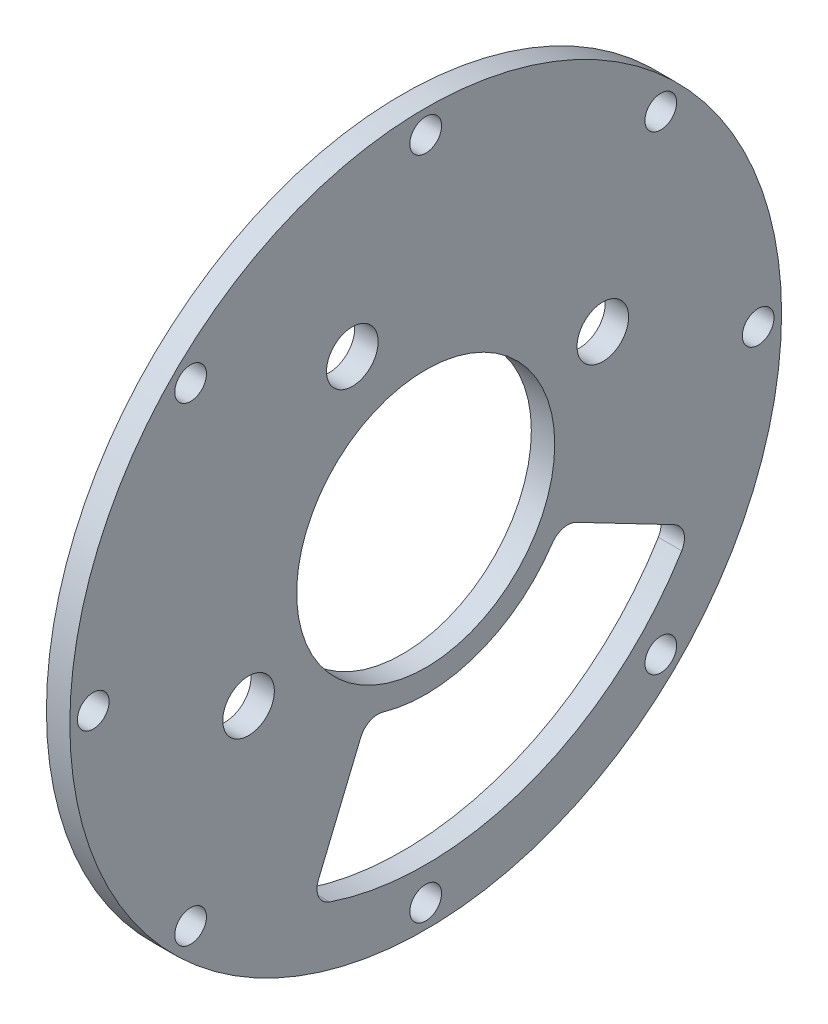
ISO-10303-21;
HEADER;
FILE_DESCRIPTION(('STEP AP214'),'2;1');
FILE_NAME('part.step','',(''),(''),'','','');
FILE_SCHEMA(('AUTOMOTIVE_DESIGN { 1 0 10303 214 1 1 1 1 }'));
ENDSEC;
DATA;
#1=APPLICATION_CONTEXT('core data for automotive mechanical design processes');
#2=APPLICATION_PROTOCOL_DEFINITION('international standard','automotive_design',2000,#1);
#3=PRODUCT_CONTEXT('',#1,'mechanical');
#4=PRODUCT('Part','Part','',(#3));
#5=PRODUCT_RELATED_PRODUCT_CATEGORY('part','',(#4));
#6=PRODUCT_DEFINITION_FORMATION('','',#4);
#7=PRODUCT_DEFINITION_CONTEXT('part definition',#1,'design');
#8=PRODUCT_DEFINITION('design','',#6,#7);
#9=PRODUCT_DEFINITION_SHAPE('','',#8);
#10=(LENGTH_UNIT() NAMED_UNIT(*) SI_UNIT(.MILLI.,.METRE.));
#11=(NAMED_UNIT(*) PLANE_ANGLE_UNIT() SI_UNIT($,.RADIAN.));
#12=(NAMED_UNIT(*) SI_UNIT($,.STERADIAN.) SOLID_ANGLE_UNIT());
#13=UNCERTAINTY_MEASURE_WITH_UNIT(LENGTH_MEASURE(1.E-05),#10,'distance_accuracy_value','');
#14=(GEOMETRIC_REPRESENTATION_CONTEXT(3) GLOBAL_UNCERTAINTY_ASSIGNED_CONTEXT((#13)) GLOBAL_UNIT_ASSIGNED_CONTEXT((#10,
#11,#12)) REPRESENTATION_CONTEXT('',''));
#15=CARTESIAN_POINT('',(0.,0.,0.));
#16=DIRECTION('',(0.,0.,1.));
#17=DIRECTION('',(1.,0.,0.));
#18=AXIS2_PLACEMENT_3D('',#15,#16,#17);
#19=CARTESIAN_POINT('',(3.175,0.,0.));
#20=DIRECTION('',(1.,0.,0.));
#21=DIRECTION('',(0.,0.,-1.));
#22=AXIS2_PLACEMENT_3D('',#19,#20,#21);
#23=PLANE('',#22);
#24=CARTESIAN_POINT('',(3.175,0.,0.));
#25=DIRECTION('',(1.,0.,0.));
#26=DIRECTION('',(0.,0.,-1.));
#27=AXIS2_PLACEMENT_3D('',#24,#25,#26);
#28=CIRCLE('',#27,17.5);
#29=CARTESIAN_POINT('',(3.175,0.,-17.5));
#30=VERTEX_POINT('',#29);
#31=EDGE_CURVE('E164',#30,#30,#28,.T.);
#32=ORIENTED_EDGE('',*,*,#31,.F.);
#33=EDGE_LOOP('',(#32));
#34=FACE_BOUND('',#33,.T.);
#35=CARTESIAN_POINT('',(3.175,-6.59194920871187E-13,45.0849999999993));
#36=DIRECTION('',(1.,0.,0.));
#37=DIRECTION('',(0.,0.,-1.));
#38=AXIS2_PLACEMENT_3D('',#35,#36,#37);
#39=CIRCLE('',#38,2.15264999999998);
#40=CARTESIAN_POINT('',(3.175,-6.59194920871187E-13,42.9323499999993));
#41=VERTEX_POINT('',#40);
#42=EDGE_CURVE('E176',#41,#41,#39,.T.);
#43=ORIENTED_EDGE('',*,*,#42,.F.);
#44=EDGE_LOOP('',(#43));
#45=FACE_BOUND('',#44,.T.);
#46=CARTESIAN_POINT('',(3.175,-45.085,-1.27675647831893E-12));
#47=DIRECTION('',(1.,0.,0.));
#48=DIRECTION('',(0.,0.,-1.));
#49=AXIS2_PLACEMENT_3D('',#46,#47,#48);
#50=CIRCLE('',#49,2.15265000000001);
#51=CARTESIAN_POINT('',(3.175,-45.085,-2.15265000000128));
#52=VERTEX_POINT('',#51);
#53=EDGE_CURVE('E188',#52,#52,#50,.T.);
#54=ORIENTED_EDGE('',*,*,#53,.F.);
#55=EDGE_LOOP('',(#54));
#56=FACE_BOUND('',#55,.T.);
#57=CARTESIAN_POINT('',(3.175,24.0239680756289,9.95038529971896));
#58=DIRECTION('',(1.,0.,0.));
#59=DIRECTION('',(0.,0.,1.));
#60=AXIS2_PLACEMENT_3D('',#57,#58,#59);
#61=CIRCLE('',#60,3.49999999999999);
#62=CARTESIAN_POINT('',(3.175,24.0239680756289,13.4503852997189));
#63=VERTEX_POINT('',#62);
#64=EDGE_CURVE('E200',#63,#63,#61,.T.);
#65=ORIENTED_EDGE('',*,*,#64,.F.);
#66=EDGE_LOOP('',(#65));
#67=FACE_BOUND('',#66,.T.);
#68=CARTESIAN_POINT('',(3.175,-1.59594559789866E-13,-45.085));
#69=DIRECTION('',(1.,0.,0.));
#70=DIRECTION('',(0.,0.,-1.));
#71=AXIS2_PLACEMENT_3D('',#68,#69,#70);
#72=CIRCLE('',#71,2.15265000000001);
#73=CARTESIAN_POINT('',(3.175,-1.59594559789866E-13,-47.23765));
#74=VERTEX_POINT('',#73);
#75=EDGE_CURVE('E212',#74,#74,#72,.T.);
#76=ORIENTED_EDGE('',*,*,#75,.F.);
#77=EDGE_LOOP('',(#76));
#78=FACE_BOUND('',#77,.T.);
#79=CARTESIAN_POINT('',(3.175,-9.95080194897357,24.023795501211));
#80=DIRECTION('',(1.,0.,0.));
#81=DIRECTION('',(0.,0.,-1.));
#82=AXIS2_PLACEMENT_3D('',#79,#80,#81);
#83=CIRCLE('',#82,3.49999999999999);
#84=CARTESIAN_POINT('',(3.175,-9.95080194897357,20.523795501211));
#85=VERTEX_POINT('',#84);
#86=EDGE_CURVE('E224',#85,#85,#83,.T.);
#87=ORIENTED_EDGE('',*,*,#86,.F.);
#88=EDGE_LOOP('',(#87));
#89=FACE_BOUND('',#88,.T.);
#90=CARTESIAN_POINT('',(3.175,0.,0.));
#91=DIRECTION('',(1.,0.,0.));
#92=DIRECTION('',(0.,0.,-1.));
#93=AXIS2_PLACEMENT_3D('',#90,#91,#92);
#94=CIRCLE('',#93,48.26);
#95=CARTESIAN_POINT('',(3.175,0.,-48.26));
#96=VERTEX_POINT('',#95);
#97=EDGE_CURVE('E11',#96,#96,#94,.T.);
#98=ORIENTED_EDGE('',*,*,#97,.T.);
#99=EDGE_LOOP('',(#98));
#100=FACE_BOUND('',#99,.T.);
#101=CARTESIAN_POINT('',(3.175,45.085,0.));
#102=DIRECTION('',(1.,0.,0.));
#103=DIRECTION('',(0.,0.,-1.));
#104=AXIS2_PLACEMENT_3D('',#101,#102,#103);
#105=CIRCLE('',#104,2.15265000000001);
#106=CARTESIAN_POINT('',(3.175,45.085,-2.15265000000001));
#107=VERTEX_POINT('',#106);
#108=EDGE_CURVE('E230',#107,#107,#105,.T.);
#109=ORIENTED_EDGE('',*,*,#108,.F.);
#110=EDGE_LOOP('',(#109));
#111=FACE_BOUND('',#110,.T.);
#112=CARTESIAN_POINT('',(3.175,31.8799092297954,-31.8799092297956));
#113=DIRECTION('',(1.,0.,0.));
#114=DIRECTION('',(0.,0.,-1.));
#115=AXIS2_PLACEMENT_3D('',#112,#113,#114);
#116=CIRCLE('',#115,2.15265000000001);
#117=CARTESIAN_POINT('',(3.175,31.8799092297954,-34.0325592297956));
#118=VERTEX_POINT('',#117);
#119=EDGE_CURVE('E218',#118,#118,#116,.T.);
#120=ORIENTED_EDGE('',*,*,#119,.F.);
#121=EDGE_LOOP('',(#120));
#122=FACE_BOUND('',#121,.T.);
#123=CARTESIAN_POINT('',(3.175,9.94801274798736,-24.0182399849756));
#124=DIRECTION('',(1.,0.,0.));
#125=DIRECTION('',(0.,0.,-1.));
#126=AXIS2_PLACEMENT_3D('',#123,#124,#125);
#127=CIRCLE('',#126,3.50000000000001);
#128=CARTESIAN_POINT('',(3.175,9.94801274798736,-27.5182399849756));
#129=VERTEX_POINT('',#128);
#130=EDGE_CURVE('E206',#129,#129,#127,.T.);
#131=ORIENTED_EDGE('',*,*,#130,.F.);
#132=EDGE_LOOP('',(#131));
#133=FACE_BOUND('',#132,.T.);
#134=CARTESIAN_POINT('',(3.175,-31.879909229795,-31.8799092297966));
#135=DIRECTION('',(1.,0.,0.));
#136=DIRECTION('',(0.,0.,-1.));
#137=AXIS2_PLACEMENT_3D('',#134,#135,#136);
#138=CIRCLE('',#137,2.15264999999998);
#139=CARTESIAN_POINT('',(3.175,-31.879909229795,-34.0325592297966));
#140=VERTEX_POINT('',#139);
#141=EDGE_CURVE('E194',#140,#140,#138,.T.);
#142=ORIENTED_EDGE('',*,*,#141,.F.);
#143=EDGE_LOOP('',(#142));
#144=FACE_BOUND('',#143,.T.);
#145=CARTESIAN_POINT('',(3.175,-31.879909229796,31.8799092297944));
#146=DIRECTION('',(1.,0.,0.));
#147=DIRECTION('',(0.,0.,-1.));
#148=AXIS2_PLACEMENT_3D('',#145,#146,#147);
#149=CIRCLE('',#148,2.15264999999998);
#150=CARTESIAN_POINT('',(3.175,-31.879909229796,29.7272592297944));
#151=VERTEX_POINT('',#150);
#152=EDGE_CURVE('E182',#151,#151,#149,.T.);
#153=ORIENTED_EDGE('',*,*,#152,.F.);
#154=EDGE_LOOP('',(#153));
#155=FACE_BOUND('',#154,.T.);
#156=CARTESIAN_POINT('',(3.175,31.8799092297959,31.8799092297951));
#157=DIRECTION('',(1.,0.,0.));
#158=DIRECTION('',(0.,0.,-1.));
#159=AXIS2_PLACEMENT_3D('',#156,#157,#158);
#160=CIRCLE('',#159,2.15264999999998);
#161=CARTESIAN_POINT('',(3.175,31.8799092297959,29.7272592297951));
#162=VERTEX_POINT('',#161);
#163=EDGE_CURVE('E170',#162,#162,#160,.T.);
#164=ORIENTED_EDGE('',*,*,#163,.F.);
#165=EDGE_LOOP('',(#164));
#166=FACE_BOUND('',#165,.T.);
#167=CARTESIAN_POINT('',(3.175,0.,0.));
#168=DIRECTION('',(-1.,0.,0.));
#169=DIRECTION('',(0.,0.,1.));
#170=AXIS2_PLACEMENT_3D('',#167,#168,#169);
#171=CIRCLE('',#170,20.6374999999999);
#172=CARTESIAN_POINT('',(3.175,-11.4780442266633,-17.1511197004965));
#173=VERTEX_POINT('',#172);
#174=CARTESIAN_POINT('',(3.175,-19.8172192334389,5.76057532750126));
#175=VERTEX_POINT('',#174);
#176=EDGE_CURVE('E107',#173,#175,#171,.T.);
#177=ORIENTED_EDGE('',*,*,#176,.F.);
#178=CARTESIAN_POINT('',(3.175,-12.8907265930218,-19.2620267405576));
#179=DIRECTION('',(1.,0.,0.));
#180=DIRECTION('',(0.,0.,-1.));
#181=AXIS2_PLACEMENT_3D('',#178,#179,#180);
#182=CIRCLE('',#181,2.54);
#183=CARTESIAN_POINT('',(3.175,-10.6377190767492,-20.4348682181746));
#184=VERTEX_POINT('',#183);
#185=EDGE_CURVE('E99',#184,#173,#182,.T.);
#186=ORIENTED_EDGE('',*,*,#185,.F.);
#187=DIRECTION('',(0.,0.461748613235052,0.887010833178213));
#188=VECTOR('',#187,1.);
#189=CARTESIAN_POINT('',(3.175,-10.6377190767492,-20.4348682181746));
#190=LINE('',#189,#188);
#191=CARTESIAN_POINT('',(3.175,-17.5534839129624,-33.7199288628752));
#192=VERTEX_POINT('',#191);
#193=EDGE_CURVE('E132',#192,#184,#190,.T.);
#194=ORIENTED_EDGE('',*,*,#193,.F.);
#195=CARTESIAN_POINT('',(3.175,-19.8064914292351,-32.5470873852582));
#196=DIRECTION('',(1.,0.,0.));
#197=DIRECTION('',(0.,0.,1.));
#198=AXIS2_PLACEMENT_3D('',#195,#196,#197);
#199=CIRCLE('',#198,2.54000000000002);
#200=CARTESIAN_POINT('',(3.175,-21.1269241911841,-34.7168932109421));
#201=VERTEX_POINT('',#200);
#202=EDGE_CURVE('E130',#201,#192,#199,.T.);
#203=ORIENTED_EDGE('',*,*,#202,.F.);
#204=CARTESIAN_POINT('',(3.175,0.,0.));
#205=DIRECTION('',(1.,0.,0.));
#206=DIRECTION('',(0.,0.,1.));
#207=AXIS2_PLACEMENT_3D('',#204,#205,#206);
#208=CIRCLE('',#207,40.6399999999999);
#209=CARTESIAN_POINT('',(3.175,-38.4997516796562,13.0145580257188));
#210=VERTEX_POINT('',#209);
#211=EDGE_CURVE('E128',#210,#201,#208,.T.);
#212=ORIENTED_EDGE('',*,*,#211,.F.);
#213=CARTESIAN_POINT('',(3.175,-36.0935171996777,12.2011481491114));
#214=DIRECTION('',(1.,0.,0.));
#215=DIRECTION('',(0.,0.,1.));
#216=AXIS2_PLACEMENT_3D('',#213,#214,#215);
#217=CIRCLE('',#216,2.53999999999999);
#218=CARTESIAN_POINT('',(3.175,-35.1215012814703,14.54780216169));
#219=VERTEX_POINT('',#218);
#220=EDGE_CURVE('E126',#219,#210,#217,.T.);
#221=ORIENTED_EDGE('',*,*,#220,.F.);
#222=DIRECTION('',(0.,-0.923879532511278,0.38268343236511));
#223=VECTOR('',#222,1.);
#224=CARTESIAN_POINT('',(3.175,-21.284245682424,8.81622322654163));
#225=LINE('',#224,#223);
#226=CARTESIAN_POINT('',(3.175,-21.284245682424,8.81622322654163));
#227=VERTEX_POINT('',#226);
#228=EDGE_CURVE('E122',#227,#219,#225,.T.);
#229=ORIENTED_EDGE('',*,*,#228,.F.);
#230=CARTESIAN_POINT('',(3.175,-22.2562616006314,6.46956921396297));
#231=DIRECTION('',(1.,0.,0.));
#232=DIRECTION('',(0.,0.,-1.));
#233=AXIS2_PLACEMENT_3D('',#230,#231,#232);
#234=CIRCLE('',#233,2.54000000000001);
#235=EDGE_CURVE('E120',#175,#227,#234,.T.);
#236=ORIENTED_EDGE('',*,*,#235,.F.);
#237=EDGE_LOOP('',(#177,#186,#194,#203,#212,#221,#229,#236));
#238=FACE_BOUND('',#237,.T.);
#239=ADVANCED_FACE('F34',(#34,#45,#56,#67,#78,#89,#100,#111,#122,#133,#144,#155,#166,#238),#23,.T.);
#240=CARTESIAN_POINT('',(0.,0.,0.));
#241=DIRECTION('',(1.,0.,0.));
#242=DIRECTION('',(0.,0.,-1.));
#243=AXIS2_PLACEMENT_3D('',#240,#241,#242);
#244=PLANE('',#243);
#245=CARTESIAN_POINT('',(0.,0.,0.));
#246=DIRECTION('',(1.,0.,0.));
#247=DIRECTION('',(0.,0.,-1.));
#248=AXIS2_PLACEMENT_3D('',#245,#246,#247);
#249=CIRCLE('',#248,17.5);
#250=CARTESIAN_POINT('',(0.,0.,-17.5));
#251=VERTEX_POINT('',#250);
#252=EDGE_CURVE('E115',#251,#251,#249,.T.);
#253=ORIENTED_EDGE('',*,*,#252,.T.);
#254=EDGE_LOOP('',(#253));
#255=FACE_BOUND('',#254,.T.);
#256=CARTESIAN_POINT('',(0.,-6.59194920871187E-13,45.0849999999993));
#257=DIRECTION('',(1.,0.,0.));
#258=DIRECTION('',(0.,0.,-1.));
#259=AXIS2_PLACEMENT_3D('',#256,#257,#258);
#260=CIRCLE('',#259,2.15264999999998);
#261=CARTESIAN_POINT('',(0.,-6.59194920871187E-13,42.9323499999993));
#262=VERTEX_POINT('',#261);
#263=EDGE_CURVE('E173',#262,#262,#260,.T.);
#264=ORIENTED_EDGE('',*,*,#263,.T.);
#265=EDGE_LOOP('',(#264));
#266=FACE_BOUND('',#265,.T.);
#267=CARTESIAN_POINT('',(0.,-45.085,-1.27675647831893E-12));
#268=DIRECTION('',(1.,0.,0.));
#269=DIRECTION('',(0.,0.,-1.));
#270=AXIS2_PLACEMENT_3D('',#267,#268,#269);
#271=CIRCLE('',#270,2.15265000000001);
#272=CARTESIAN_POINT('',(0.,-45.085,-2.15265000000128));
#273=VERTEX_POINT('',#272);
#274=EDGE_CURVE('E185',#273,#273,#271,.T.);
#275=ORIENTED_EDGE('',*,*,#274,.T.);
#276=EDGE_LOOP('',(#275));
#277=FACE_BOUND('',#276,.T.);
#278=CARTESIAN_POINT('',(0.,24.0239680756289,9.95038529971896));
#279=DIRECTION('',(1.,0.,0.));
#280=DIRECTION('',(0.,0.,1.));
#281=AXIS2_PLACEMENT_3D('',#278,#279,#280);
#282=CIRCLE('',#281,3.49999999999999);
#283=CARTESIAN_POINT('',(0.,24.0239680756289,13.4503852997189));
#284=VERTEX_POINT('',#283);
#285=EDGE_CURVE('E197',#284,#284,#282,.T.);
#286=ORIENTED_EDGE('',*,*,#285,.T.);
#287=EDGE_LOOP('',(#286));
#288=FACE_BOUND('',#287,.T.);
#289=CARTESIAN_POINT('',(0.,-1.59594559789866E-13,-45.085));
#290=DIRECTION('',(1.,0.,0.));
#291=DIRECTION('',(0.,0.,-1.));
#292=AXIS2_PLACEMENT_3D('',#289,#290,#291);
#293=CIRCLE('',#292,2.15265000000001);
#294=CARTESIAN_POINT('',(0.,-1.59594559789866E-13,-47.23765));
#295=VERTEX_POINT('',#294);
#296=EDGE_CURVE('E209',#295,#295,#293,.T.);
#297=ORIENTED_EDGE('',*,*,#296,.T.);
#298=EDGE_LOOP('',(#297));
#299=FACE_BOUND('',#298,.T.);
#300=CARTESIAN_POINT('',(0.,-9.95080194897357,24.023795501211));
#301=DIRECTION('',(1.,0.,0.));
#302=DIRECTION('',(0.,0.,-1.));
#303=AXIS2_PLACEMENT_3D('',#300,#301,#302);
#304=CIRCLE('',#303,3.49999999999999);
#305=CARTESIAN_POINT('',(0.,-9.95080194897357,20.523795501211));
#306=VERTEX_POINT('',#305);
#307=EDGE_CURVE('E221',#306,#306,#304,.T.);
#308=ORIENTED_EDGE('',*,*,#307,.T.);
#309=EDGE_LOOP('',(#308));
#310=FACE_BOUND('',#309,.T.);
#311=CARTESIAN_POINT('',(0.,0.,0.));
#312=DIRECTION('',(1.,0.,0.));
#313=DIRECTION('',(0.,0.,-1.));
#314=AXIS2_PLACEMENT_3D('',#311,#312,#313);
#315=CIRCLE('',#314,48.26);
#316=CARTESIAN_POINT('',(0.,0.,-48.26));
#317=VERTEX_POINT('',#316);
#318=EDGE_CURVE('E38',#317,#317,#315,.T.);
#319=ORIENTED_EDGE('',*,*,#318,.F.);
#320=EDGE_LOOP('',(#319));
#321=FACE_BOUND('',#320,.T.);
#322=CARTESIAN_POINT('',(0.,45.085,0.));
#323=DIRECTION('',(1.,0.,0.));
#324=DIRECTION('',(0.,0.,-1.));
#325=AXIS2_PLACEMENT_3D('',#322,#323,#324);
#326=CIRCLE('',#325,2.15265000000001);
#327=CARTESIAN_POINT('',(0.,45.085,-2.15265000000001));
#328=VERTEX_POINT('',#327);
#329=EDGE_CURVE('E227',#328,#328,#326,.T.);
#330=ORIENTED_EDGE('',*,*,#329,.T.);
#331=EDGE_LOOP('',(#330));
#332=FACE_BOUND('',#331,.T.);
#333=CARTESIAN_POINT('',(0.,31.8799092297954,-31.8799092297956));
#334=DIRECTION('',(1.,0.,0.));
#335=DIRECTION('',(0.,0.,-1.));
#336=AXIS2_PLACEMENT_3D('',#333,#334,#335);
#337=CIRCLE('',#336,2.15265000000001);
#338=CARTESIAN_POINT('',(0.,31.8799092297954,-34.0325592297956));
#339=VERTEX_POINT('',#338);
#340=EDGE_CURVE('E215',#339,#339,#337,.T.);
#341=ORIENTED_EDGE('',*,*,#340,.T.);
#342=EDGE_LOOP('',(#341));
#343=FACE_BOUND('',#342,.T.);
#344=CARTESIAN_POINT('',(0.,9.94801274798736,-24.0182399849756));
#345=DIRECTION('',(1.,0.,0.));
#346=DIRECTION('',(0.,0.,-1.));
#347=AXIS2_PLACEMENT_3D('',#344,#345,#346);
#348=CIRCLE('',#347,3.50000000000001);
#349=CARTESIAN_POINT('',(0.,9.94801274798736,-27.5182399849756));
#350=VERTEX_POINT('',#349);
#351=EDGE_CURVE('E203',#350,#350,#348,.T.);
#352=ORIENTED_EDGE('',*,*,#351,.T.);
#353=EDGE_LOOP('',(#352));
#354=FACE_BOUND('',#353,.T.);
#355=CARTESIAN_POINT('',(0.,-31.879909229795,-31.8799092297966));
#356=DIRECTION('',(1.,0.,0.));
#357=DIRECTION('',(0.,0.,-1.));
#358=AXIS2_PLACEMENT_3D('',#355,#356,#357);
#359=CIRCLE('',#358,2.15264999999998);
#360=CARTESIAN_POINT('',(0.,-31.879909229795,-34.0325592297966));
#361=VERTEX_POINT('',#360);
#362=EDGE_CURVE('E191',#361,#361,#359,.T.);
#363=ORIENTED_EDGE('',*,*,#362,.T.);
#364=EDGE_LOOP('',(#363));
#365=FACE_BOUND('',#364,.T.);
#366=CARTESIAN_POINT('',(0.,-31.879909229796,31.8799092297944));
#367=DIRECTION('',(1.,0.,0.));
#368=DIRECTION('',(0.,0.,-1.));
#369=AXIS2_PLACEMENT_3D('',#366,#367,#368);
#370=CIRCLE('',#369,2.15264999999998);
#371=CARTESIAN_POINT('',(0.,-31.879909229796,29.7272592297944));
#372=VERTEX_POINT('',#371);
#373=EDGE_CURVE('E179',#372,#372,#370,.T.);
#374=ORIENTED_EDGE('',*,*,#373,.T.);
#375=EDGE_LOOP('',(#374));
#376=FACE_BOUND('',#375,.T.);
#377=CARTESIAN_POINT('',(0.,31.8799092297959,31.8799092297951));
#378=DIRECTION('',(1.,0.,0.));
#379=DIRECTION('',(0.,0.,-1.));
#380=AXIS2_PLACEMENT_3D('',#377,#378,#379);
#381=CIRCLE('',#380,2.15264999999998);
#382=CARTESIAN_POINT('',(0.,31.8799092297959,29.7272592297951));
#383=VERTEX_POINT('',#382);
#384=EDGE_CURVE('E167',#383,#383,#381,.T.);
#385=ORIENTED_EDGE('',*,*,#384,.T.);
#386=EDGE_LOOP('',(#385));
#387=FACE_BOUND('',#386,.T.);
#388=CARTESIAN_POINT('',(0.,-12.8907265930218,-19.2620267405576));
#389=DIRECTION('',(1.,0.,0.));
#390=DIRECTION('',(0.,0.,-1.));
#391=AXIS2_PLACEMENT_3D('',#388,#389,#390);
#392=CIRCLE('',#391,2.54);
#393=CARTESIAN_POINT('',(0.,-10.6377190767492,-20.4348682181746));
#394=VERTEX_POINT('',#393);
#395=CARTESIAN_POINT('',(0.,-11.4780442266633,-17.1511197004965));
#396=VERTEX_POINT('',#395);
#397=EDGE_CURVE('E57',#394,#396,#392,.T.);
#398=ORIENTED_EDGE('',*,*,#397,.T.);
#399=CARTESIAN_POINT('',(0.,0.,0.));
#400=DIRECTION('',(-1.,0.,0.));
#401=DIRECTION('',(0.,0.,1.));
#402=AXIS2_PLACEMENT_3D('',#399,#400,#401);
#403=CIRCLE('',#402,20.6374999999999);
#404=CARTESIAN_POINT('',(0.,-19.8172192334389,5.76057532750126));
#405=VERTEX_POINT('',#404);
#406=EDGE_CURVE('E114',#396,#405,#403,.T.);
#407=ORIENTED_EDGE('',*,*,#406,.T.);
#408=CARTESIAN_POINT('',(0.,-22.2562616006314,6.46956921396297));
#409=DIRECTION('',(1.,0.,0.));
#410=DIRECTION('',(0.,0.,-1.));
#411=AXIS2_PLACEMENT_3D('',#408,#409,#410);
#412=CIRCLE('',#411,2.54000000000001);
#413=CARTESIAN_POINT('',(0.,-21.284245682424,8.81622322654163));
#414=VERTEX_POINT('',#413);
#415=EDGE_CURVE('E136',#405,#414,#412,.T.);
#416=ORIENTED_EDGE('',*,*,#415,.T.);
#417=DIRECTION('',(0.,-0.923879532511278,0.38268343236511));
#418=VECTOR('',#417,1.);
#419=CARTESIAN_POINT('',(0.,-21.284245682424,8.81622322654163));
#420=LINE('',#419,#418);
#421=CARTESIAN_POINT('',(0.,-35.1215012814703,14.54780216169));
#422=VERTEX_POINT('',#421);
#423=EDGE_CURVE('E139',#414,#422,#420,.T.);
#424=ORIENTED_EDGE('',*,*,#423,.T.);
#425=CARTESIAN_POINT('',(0.,-36.0935171996777,12.2011481491114));
#426=DIRECTION('',(1.,0.,0.));
#427=DIRECTION('',(0.,0.,1.));
#428=AXIS2_PLACEMENT_3D('',#425,#426,#427);
#429=CIRCLE('',#428,2.53999999999999);
#430=CARTESIAN_POINT('',(0.,-38.4997516796562,13.0145580257188));
#431=VERTEX_POINT('',#430);
#432=EDGE_CURVE('E142',#422,#431,#429,.T.);
#433=ORIENTED_EDGE('',*,*,#432,.T.);
#434=CARTESIAN_POINT('',(0.,0.,0.));
#435=DIRECTION('',(1.,0.,0.));
#436=DIRECTION('',(0.,0.,1.));
#437=AXIS2_PLACEMENT_3D('',#434,#435,#436);
#438=CIRCLE('',#437,40.6399999999999);
#439=CARTESIAN_POINT('',(0.,-21.1269241911841,-34.7168932109421));
#440=VERTEX_POINT('',#439);
#441=EDGE_CURVE('E145',#431,#440,#438,.T.);
#442=ORIENTED_EDGE('',*,*,#441,.T.);
#443=CARTESIAN_POINT('',(0.,-19.8064914292351,-32.5470873852582));
#444=DIRECTION('',(1.,0.,0.));
#445=DIRECTION('',(0.,0.,1.));
#446=AXIS2_PLACEMENT_3D('',#443,#444,#445);
#447=CIRCLE('',#446,2.54000000000002);
#448=CARTESIAN_POINT('',(0.,-17.5534839129624,-33.7199288628752));
#449=VERTEX_POINT('',#448);
#450=EDGE_CURVE('E148',#440,#449,#447,.T.);
#451=ORIENTED_EDGE('',*,*,#450,.T.);
#452=DIRECTION('',(0.,0.461748613235052,0.887010833178213));
#453=VECTOR('',#452,1.);
#454=CARTESIAN_POINT('',(0.,-10.6377190767492,-20.4348682181746));
#455=LINE('',#454,#453);
#456=EDGE_CURVE('E108',#449,#394,#455,.T.);
#457=ORIENTED_EDGE('',*,*,#456,.T.);
#458=EDGE_LOOP('',(#398,#407,#416,#424,#433,#442,#451,#457));
#459=FACE_BOUND('',#458,.T.);
#460=ADVANCED_FACE('F236',(#255,#266,#277,#288,#299,#310,#321,#332,#343,#354,#365,#376,#387,
#459),#244,.F.);
#461=CARTESIAN_POINT('',(3.175,0.,0.));
#462=DIRECTION('',(-1.,0.,0.));
#463=DIRECTION('',(0.,0.,1.));
#464=AXIS2_PLACEMENT_3D('',#461,#462,#463);
#465=CYLINDRICAL_SURFACE('',#464,48.26);
#466=ORIENTED_EDGE('',*,*,#97,.F.);
#467=EDGE_LOOP('',(#466));
#468=FACE_BOUND('',#467,.T.);
#469=ORIENTED_EDGE('',*,*,#318,.T.);
#470=EDGE_LOOP('',(#469));
#471=FACE_BOUND('',#470,.T.);
#472=ADVANCED_FACE('F36',(#468,#471),#465,.T.);
#473=CARTESIAN_POINT('',(3.175,45.085,0.));
#474=DIRECTION('',(-1.,0.,0.));
#475=DIRECTION('',(0.,0.,1.));
#476=AXIS2_PLACEMENT_3D('',#473,#474,#475);
#477=CYLINDRICAL_SURFACE('',#476,2.15265000000001);
#478=ORIENTED_EDGE('',*,*,#108,.T.);
#479=EDGE_LOOP('',(#478));
#480=FACE_BOUND('',#479,.T.);
#481=ORIENTED_EDGE('',*,*,#329,.F.);
#482=EDGE_LOOP('',(#481));
#483=FACE_BOUND('',#482,.T.);
#484=ADVANCED_FACE('F239',(#480,#483),#477,.F.);
#485=CARTESIAN_POINT('',(3.175,-9.95080194897357,24.023795501211));
#486=DIRECTION('',(-1.,0.,0.));
#487=DIRECTION('',(0.,0.,1.));
#488=AXIS2_PLACEMENT_3D('',#485,#486,#487);
#489=CYLINDRICAL_SURFACE('',#488,3.49999999999999);
#490=ORIENTED_EDGE('',*,*,#86,.T.);
#491=EDGE_LOOP('',(#490));
#492=FACE_BOUND('',#491,.T.);
#493=ORIENTED_EDGE('',*,*,#307,.F.);
#494=EDGE_LOOP('',(#493));
#495=FACE_BOUND('',#494,.T.);
#496=ADVANCED_FACE('F241',(#492,#495),#489,.F.);
#497=CARTESIAN_POINT('',(3.175,31.8799092297954,-31.8799092297956));
#498=DIRECTION('',(-1.,0.,0.));
#499=DIRECTION('',(0.,0.,1.));
#500=AXIS2_PLACEMENT_3D('',#497,#498,#499);
#501=CYLINDRICAL_SURFACE('',#500,2.15265000000001);
#502=ORIENTED_EDGE('',*,*,#119,.T.);
#503=EDGE_LOOP('',(#502));
#504=FACE_BOUND('',#503,.T.);
#505=ORIENTED_EDGE('',*,*,#340,.F.);
#506=EDGE_LOOP('',(#505));
#507=FACE_BOUND('',#506,.T.);
#508=ADVANCED_FACE('F248',(#504,#507),#501,.F.);
#509=CARTESIAN_POINT('',(3.175,-1.59594559789866E-13,-45.085));
#510=DIRECTION('',(-1.,0.,0.));
#511=DIRECTION('',(0.,0.,1.));
#512=AXIS2_PLACEMENT_3D('',#509,#510,#511);
#513=CYLINDRICAL_SURFACE('',#512,2.15265000000001);
#514=ORIENTED_EDGE('',*,*,#75,.T.);
#515=EDGE_LOOP('',(#514));
#516=FACE_BOUND('',#515,.T.);
#517=ORIENTED_EDGE('',*,*,#296,.F.);
#518=EDGE_LOOP('',(#517));
#519=FACE_BOUND('',#518,.T.);
#520=ADVANCED_FACE('F354',(#516,#519),#513,.F.);
#521=CARTESIAN_POINT('',(3.175,9.94801274798736,-24.0182399849756));
#522=DIRECTION('',(-1.,0.,0.));
#523=DIRECTION('',(0.,0.,1.));
#524=AXIS2_PLACEMENT_3D('',#521,#522,#523);
#525=CYLINDRICAL_SURFACE('',#524,3.50000000000001);
#526=ORIENTED_EDGE('',*,*,#130,.T.);
#527=EDGE_LOOP('',(#526));
#528=FACE_BOUND('',#527,.T.);
#529=ORIENTED_EDGE('',*,*,#351,.F.);
#530=EDGE_LOOP('',(#529));
#531=FACE_BOUND('',#530,.T.);
#532=ADVANCED_FACE('F350',(#528,#531),#525,.F.);
#533=CARTESIAN_POINT('',(3.175,24.0239680756289,9.95038529971896));
#534=DIRECTION('',(-1.,0.,0.));
#535=DIRECTION('',(0.,0.,1.));
#536=AXIS2_PLACEMENT_3D('',#533,#534,#535);
#537=CYLINDRICAL_SURFACE('',#536,3.49999999999999);
#538=ORIENTED_EDGE('',*,*,#64,.T.);
#539=EDGE_LOOP('',(#538));
#540=FACE_BOUND('',#539,.T.);
#541=ORIENTED_EDGE('',*,*,#285,.F.);
#542=EDGE_LOOP('',(#541));
#543=FACE_BOUND('',#542,.T.);
#544=ADVANCED_FACE('F346',(#540,#543),#537,.F.);
#545=CARTESIAN_POINT('',(3.175,-31.879909229795,-31.8799092297966));
#546=DIRECTION('',(-1.,0.,0.));
#547=DIRECTION('',(0.,0.,1.));
#548=AXIS2_PLACEMENT_3D('',#545,#546,#547);
#549=CYLINDRICAL_SURFACE('',#548,2.15264999999998);
#550=ORIENTED_EDGE('',*,*,#141,.T.);
#551=EDGE_LOOP('',(#550));
#552=FACE_BOUND('',#551,.T.);
#553=ORIENTED_EDGE('',*,*,#362,.F.);
#554=EDGE_LOOP('',(#553));
#555=FACE_BOUND('',#554,.T.);
#556=ADVANCED_FACE('F342',(#552,#555),#549,.F.);
#557=CARTESIAN_POINT('',(3.175,-45.085,-1.27675647831893E-12));
#558=DIRECTION('',(-1.,0.,0.));
#559=DIRECTION('',(0.,0.,1.));
#560=AXIS2_PLACEMENT_3D('',#557,#558,#559);
#561=CYLINDRICAL_SURFACE('',#560,2.15265000000001);
#562=ORIENTED_EDGE('',*,*,#53,.T.);
#563=EDGE_LOOP('',(#562));
#564=FACE_BOUND('',#563,.T.);
#565=ORIENTED_EDGE('',*,*,#274,.F.);
#566=EDGE_LOOP('',(#565));
#567=FACE_BOUND('',#566,.T.);
#568=ADVANCED_FACE('F338',(#564,#567),#561,.F.);
#569=CARTESIAN_POINT('',(3.175,-31.879909229796,31.8799092297944));
#570=DIRECTION('',(-1.,0.,0.));
#571=DIRECTION('',(0.,0.,1.));
#572=AXIS2_PLACEMENT_3D('',#569,#570,#571);
#573=CYLINDRICAL_SURFACE('',#572,2.15264999999998);
#574=ORIENTED_EDGE('',*,*,#152,.T.);
#575=EDGE_LOOP('',(#574));
#576=FACE_BOUND('',#575,.T.);
#577=ORIENTED_EDGE('',*,*,#373,.F.);
#578=EDGE_LOOP('',(#577));
#579=FACE_BOUND('',#578,.T.);
#580=ADVANCED_FACE('F334',(#576,#579),#573,.F.);
#581=CARTESIAN_POINT('',(3.175,-6.59194920871187E-13,45.0849999999993));
#582=DIRECTION('',(-1.,0.,0.));
#583=DIRECTION('',(0.,0.,1.));
#584=AXIS2_PLACEMENT_3D('',#581,#582,#583);
#585=CYLINDRICAL_SURFACE('',#584,2.15264999999998);
#586=ORIENTED_EDGE('',*,*,#42,.T.);
#587=EDGE_LOOP('',(#586));
#588=FACE_BOUND('',#587,.T.);
#589=ORIENTED_EDGE('',*,*,#263,.F.);
#590=EDGE_LOOP('',(#589));
#591=FACE_BOUND('',#590,.T.);
#592=ADVANCED_FACE('F289',(#588,#591),#585,.F.);
#593=CARTESIAN_POINT('',(3.175,31.8799092297959,31.8799092297951));
#594=DIRECTION('',(-1.,0.,0.));
#595=DIRECTION('',(0.,0.,1.));
#596=AXIS2_PLACEMENT_3D('',#593,#594,#595);
#597=CYLINDRICAL_SURFACE('',#596,2.15264999999998);
#598=ORIENTED_EDGE('',*,*,#163,.T.);
#599=EDGE_LOOP('',(#598));
#600=FACE_BOUND('',#599,.T.);
#601=ORIENTED_EDGE('',*,*,#384,.F.);
#602=EDGE_LOOP('',(#601));
#603=FACE_BOUND('',#602,.T.);
#604=ADVANCED_FACE('F285',(#600,#603),#597,.F.);
#605=CARTESIAN_POINT('',(3.175,0.,0.));
#606=DIRECTION('',(-1.,0.,0.));
#607=DIRECTION('',(0.,0.,1.));
#608=AXIS2_PLACEMENT_3D('',#605,#606,#607);
#609=CYLINDRICAL_SURFACE('',#608,17.5);
#610=ORIENTED_EDGE('',*,*,#31,.T.);
#611=EDGE_LOOP('',(#610));
#612=FACE_BOUND('',#611,.T.);
#613=ORIENTED_EDGE('',*,*,#252,.F.);
#614=EDGE_LOOP('',(#613));
#615=FACE_BOUND('',#614,.T.);
#616=ADVANCED_FACE('F288',(#612,#615),#609,.F.);
#617=CARTESIAN_POINT('',(3.175,-12.8907265930218,-19.2620267405576));
#618=DIRECTION('',(-1.,0.,0.));
#619=DIRECTION('',(0.,0.,1.));
#620=AXIS2_PLACEMENT_3D('',#617,#618,#619);
#621=CYLINDRICAL_SURFACE('',#620,2.54);
#622=ORIENTED_EDGE('',*,*,#397,.F.);
#623=DIRECTION('',(-1.,0.,0.));
#624=VECTOR('',#623,1.);
#625=CARTESIAN_POINT('',(3.175,-10.6377190767492,-20.4348682181746));
#626=LINE('',#625,#624);
#627=EDGE_CURVE('E103',#184,#394,#626,.T.);
#628=ORIENTED_EDGE('',*,*,#627,.F.);
#629=ORIENTED_EDGE('',*,*,#185,.T.);
#630=DIRECTION('',(-1.,0.,0.));
#631=VECTOR('',#630,1.);
#632=CARTESIAN_POINT('',(3.175,-11.4780442266633,-17.1511197004965));
#633=LINE('',#632,#631);
#634=EDGE_CURVE('E102',#173,#396,#633,.T.);
#635=ORIENTED_EDGE('',*,*,#634,.T.);
#636=EDGE_LOOP('',(#622,#628,#629,#635));
#637=FACE_BOUND('',#636,.T.);
#638=ADVANCED_FACE('F101',(#637),#621,.F.);
#639=CARTESIAN_POINT('',(3.175,0.,0.));
#640=DIRECTION('',(-1.,0.,0.));
#641=DIRECTION('',(0.,0.,1.));
#642=AXIS2_PLACEMENT_3D('',#639,#640,#641);
#643=CYLINDRICAL_SURFACE('',#642,20.6374999999999);
#644=ORIENTED_EDGE('',*,*,#406,.F.);
#645=ORIENTED_EDGE('',*,*,#634,.F.);
#646=ORIENTED_EDGE('',*,*,#176,.T.);
#647=DIRECTION('',(-1.,0.,0.));
#648=VECTOR('',#647,1.);
#649=CARTESIAN_POINT('',(3.175,-19.8172192334389,5.76057532750126));
#650=LINE('',#649,#648);
#651=EDGE_CURVE('E116',#175,#405,#650,.T.);
#652=ORIENTED_EDGE('',*,*,#651,.T.);
#653=EDGE_LOOP('',(#644,#645,#646,#652));
#654=FACE_BOUND('',#653,.T.);
#655=ADVANCED_FACE('F111',(#654),#643,.T.);
#656=CARTESIAN_POINT('',(3.175,-22.2562616006314,6.46956921396297));
#657=DIRECTION('',(-1.,0.,0.));
#658=DIRECTION('',(0.,0.,1.));
#659=AXIS2_PLACEMENT_3D('',#656,#657,#658);
#660=CYLINDRICAL_SURFACE('',#659,2.54000000000001);
#661=ORIENTED_EDGE('',*,*,#415,.F.);
#662=ORIENTED_EDGE('',*,*,#651,.F.);
#663=ORIENTED_EDGE('',*,*,#235,.T.);
#664=DIRECTION('',(-1.,0.,0.));
#665=VECTOR('',#664,1.);
#666=CARTESIAN_POINT('',(3.175,-21.284245682424,8.81622322654163));
#667=LINE('',#666,#665);
#668=EDGE_CURVE('E161',#227,#414,#667,.T.);
#669=ORIENTED_EDGE('',*,*,#668,.T.);
#670=EDGE_LOOP('',(#661,#662,#663,#669));
#671=FACE_BOUND('',#670,.T.);
#672=ADVANCED_FACE('F316',(#671),#660,.F.);
#673=CARTESIAN_POINT('',(3.175,-21.284245682424,8.81622322654163));
#674=DIRECTION('',(0.,-0.38268343236511,-0.923879532511278));
#675=DIRECTION('',(0.,0.923879532511278,-0.38268343236511));
#676=AXIS2_PLACEMENT_3D('',#673,#674,#675);
#677=PLANE('',#676);
#678=ORIENTED_EDGE('',*,*,#423,.F.);
#679=ORIENTED_EDGE('',*,*,#668,.F.);
#680=ORIENTED_EDGE('',*,*,#228,.T.);
#681=DIRECTION('',(-1.,0.,0.));
#682=VECTOR('',#681,1.);
#683=CARTESIAN_POINT('',(3.175,-35.1215012814703,14.54780216169));
#684=LINE('',#683,#682);
#685=EDGE_CURVE('E159',#219,#422,#684,.T.);
#686=ORIENTED_EDGE('',*,*,#685,.T.);
#687=EDGE_LOOP('',(#678,#679,#680,#686));
#688=FACE_BOUND('',#687,.T.);
#689=ADVANCED_FACE('F313',(#688),#677,.T.);
#690=CARTESIAN_POINT('',(3.175,-36.0935171996777,12.2011481491114));
#691=DIRECTION('',(-1.,0.,0.));
#692=DIRECTION('',(0.,0.,1.));
#693=AXIS2_PLACEMENT_3D('',#690,#691,#692);
#694=CYLINDRICAL_SURFACE('',#693,2.53999999999999);
#695=ORIENTED_EDGE('',*,*,#432,.F.);
#696=ORIENTED_EDGE('',*,*,#685,.F.);
#697=ORIENTED_EDGE('',*,*,#220,.T.);
#698=DIRECTION('',(-1.,0.,0.));
#699=VECTOR('',#698,1.);
#700=CARTESIAN_POINT('',(3.175,-38.4997516796562,13.0145580257188));
#701=LINE('',#700,#699);
#702=EDGE_CURVE('E157',#210,#431,#701,.T.);
#703=ORIENTED_EDGE('',*,*,#702,.T.);
#704=EDGE_LOOP('',(#695,#696,#697,#703));
#705=FACE_BOUND('',#704,.T.);
#706=ADVANCED_FACE('F308',(#705),#694,.F.);
#707=CARTESIAN_POINT('',(3.175,0.,0.));
#708=DIRECTION('',(-1.,0.,0.));
#709=DIRECTION('',(0.,0.,1.));
#710=AXIS2_PLACEMENT_3D('',#707,#708,#709);
#711=CYLINDRICAL_SURFACE('',#710,40.6399999999999);
#712=ORIENTED_EDGE('',*,*,#441,.F.);
#713=ORIENTED_EDGE('',*,*,#702,.F.);
#714=ORIENTED_EDGE('',*,*,#211,.T.);
#715=DIRECTION('',(-1.,0.,0.));
#716=VECTOR('',#715,1.);
#717=CARTESIAN_POINT('',(3.175,-21.1269241911841,-34.7168932109421));
#718=LINE('',#717,#716);
#719=EDGE_CURVE('E155',#201,#440,#718,.T.);
#720=ORIENTED_EDGE('',*,*,#719,.T.);
#721=EDGE_LOOP('',(#712,#713,#714,#720));
#722=FACE_BOUND('',#721,.T.);
#723=ADVANCED_FACE('F304',(#722),#711,.F.);
#724=CARTESIAN_POINT('',(3.175,-19.8064914292351,-32.5470873852582));
#725=DIRECTION('',(-1.,0.,0.));
#726=DIRECTION('',(0.,0.,1.));
#727=AXIS2_PLACEMENT_3D('',#724,#725,#726);
#728=CYLINDRICAL_SURFACE('',#727,2.54000000000002);
#729=ORIENTED_EDGE('',*,*,#450,.F.);
#730=ORIENTED_EDGE('',*,*,#719,.F.);
#731=ORIENTED_EDGE('',*,*,#202,.T.);
#732=DIRECTION('',(-1.,0.,0.));
#733=VECTOR('',#732,1.);
#734=CARTESIAN_POINT('',(3.175,-17.5534839129624,-33.7199288628752));
#735=LINE('',#734,#733);
#736=EDGE_CURVE('E49',#192,#449,#735,.T.);
#737=ORIENTED_EDGE('',*,*,#736,.T.);
#738=EDGE_LOOP('',(#729,#730,#731,#737));
#739=FACE_BOUND('',#738,.T.);
#740=ADVANCED_FACE('F301',(#739),#728,.F.);
#741=CARTESIAN_POINT('',(3.175,-10.6377190767492,-20.4348682181746));
#742=DIRECTION('',(0.,-0.887010833178212,0.461748613235052));
#743=DIRECTION('',(0.,-0.461748613235052,-0.887010833178213));
#744=AXIS2_PLACEMENT_3D('',#741,#742,#743);
#745=PLANE('',#744);
#746=ORIENTED_EDGE('',*,*,#456,.F.);
#747=ORIENTED_EDGE('',*,*,#736,.F.);
#748=ORIENTED_EDGE('',*,*,#193,.T.);
#749=ORIENTED_EDGE('',*,*,#627,.T.);
#750=EDGE_LOOP('',(#746,#747,#748,#749));
#751=FACE_BOUND('',#750,.T.);
#752=ADVANCED_FACE('F295',(#751),#745,.T.);
#753=CLOSED_SHELL('',(#239,#460,#472,#484,#496,#508,#520,#532,#544,#556,#568,#580,#592,#604,
#616,#638,#655,#672,#689,#706,#723,#740,#752));
#754=MANIFOLD_SOLID_BREP('B2',#753);
#755=ADVANCED_BREP_SHAPE_REPRESENTATION('',(#18,#754),#14);
#756=SHAPE_DEFINITION_REPRESENTATION(#9,#755);
ENDSEC;
END-ISO-10303-21;
